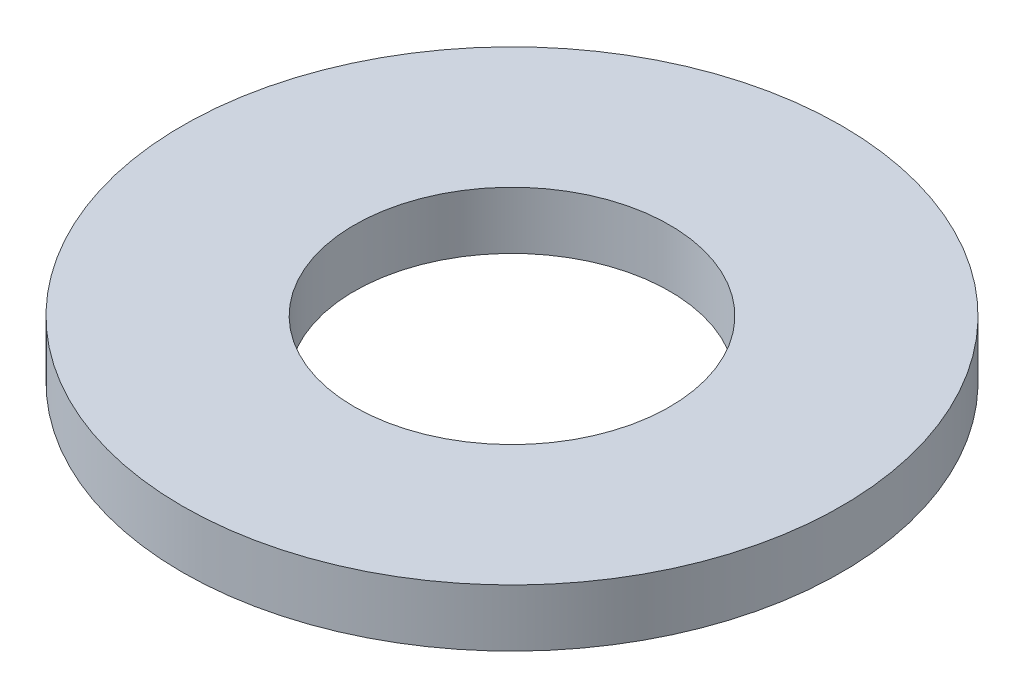
ISO-10303-21;
HEADER;
FILE_DESCRIPTION(('STEP AP214'),'2;1');
FILE_NAME('part.step','',(''),(''),'','','');
FILE_SCHEMA(('AUTOMOTIVE_DESIGN { 1 0 10303 214 1 1 1 1 }'));
ENDSEC;
DATA;
#1=APPLICATION_CONTEXT('core data for automotive mechanical design processes');
#2=APPLICATION_PROTOCOL_DEFINITION('international standard','automotive_design',2000,#1);
#3=PRODUCT_CONTEXT('',#1,'mechanical');
#4=PRODUCT('Part','Part','',(#3));
#5=PRODUCT_RELATED_PRODUCT_CATEGORY('part','',(#4));
#6=PRODUCT_DEFINITION_FORMATION('','',#4);
#7=PRODUCT_DEFINITION_CONTEXT('part definition',#1,'design');
#8=PRODUCT_DEFINITION('design','',#6,#7);
#9=PRODUCT_DEFINITION_SHAPE('','',#8);
#10=(LENGTH_UNIT() NAMED_UNIT(*) SI_UNIT(.MILLI.,.METRE.));
#11=(NAMED_UNIT(*) PLANE_ANGLE_UNIT() SI_UNIT($,.RADIAN.));
#12=(NAMED_UNIT(*) SI_UNIT($,.STERADIAN.) SOLID_ANGLE_UNIT());
#13=UNCERTAINTY_MEASURE_WITH_UNIT(LENGTH_MEASURE(1.E-05),#10,'distance_accuracy_value','');
#14=(GEOMETRIC_REPRESENTATION_CONTEXT(3) GLOBAL_UNCERTAINTY_ASSIGNED_CONTEXT((#13)) GLOBAL_UNIT_ASSIGNED_CONTEXT((#10,
#11,#12)) REPRESENTATION_CONTEXT('',''));
#15=CARTESIAN_POINT('',(0.,0.,0.));
#16=DIRECTION('',(0.,0.,1.));
#17=DIRECTION('',(1.,0.,0.));
#18=AXIS2_PLACEMENT_3D('',#15,#16,#17);
#19=CARTESIAN_POINT('',(0.,10.,0.));
#20=DIRECTION('',(0.,-1.,0.));
#21=DIRECTION('',(0.,0.,-1.));
#22=AXIS2_PLACEMENT_3D('',#19,#20,#21);
#23=CYLINDRICAL_SURFACE('',#22,57.5);
#24=CARTESIAN_POINT('',(0.,10.,0.));
#25=DIRECTION('',(0.,1.,0.));
#26=DIRECTION('',(0.,0.,1.));
#27=AXIS2_PLACEMENT_3D('',#24,#25,#26);
#28=CIRCLE('',#27,57.5);
#29=CARTESIAN_POINT('',(0.,10.,57.5));
#30=VERTEX_POINT('',#29);
#31=EDGE_CURVE('E10',#30,#30,#28,.T.);
#32=ORIENTED_EDGE('',*,*,#31,.F.);
#33=EDGE_LOOP('',(#32));
#34=FACE_BOUND('',#33,.T.);
#35=CARTESIAN_POINT('',(0.,0.,0.));
#36=DIRECTION('',(0.,1.,0.));
#37=DIRECTION('',(0.,0.,1.));
#38=AXIS2_PLACEMENT_3D('',#35,#36,#37);
#39=CIRCLE('',#38,57.5);
#40=CARTESIAN_POINT('',(0.,0.,57.5));
#41=VERTEX_POINT('',#40);
#42=EDGE_CURVE('E37',#41,#41,#39,.T.);
#43=ORIENTED_EDGE('',*,*,#42,.T.);
#44=EDGE_LOOP('',(#43));
#45=FACE_BOUND('',#44,.T.);
#46=ADVANCED_FACE('F40',(#34,#45),#23,.T.);
#47=CARTESIAN_POINT('',(0.,10.,0.));
#48=DIRECTION('',(0.,1.,0.));
#49=DIRECTION('',(0.,0.,1.));
#50=AXIS2_PLACEMENT_3D('',#47,#48,#49);
#51=PLANE('',#50);
#52=CARTESIAN_POINT('',(0.,10.,0.));
#53=DIRECTION('',(0.,1.,0.));
#54=DIRECTION('',(0.,0.,1.));
#55=AXIS2_PLACEMENT_3D('',#52,#53,#54);
#56=CIRCLE('',#55,27.5);
#57=CARTESIAN_POINT('',(0.,10.,27.5));
#58=VERTEX_POINT('',#57);
#59=EDGE_CURVE('E50',#58,#58,#56,.T.);
#60=ORIENTED_EDGE('',*,*,#59,.F.);
#61=EDGE_LOOP('',(#60));
#62=FACE_BOUND('',#61,.T.);
#63=ORIENTED_EDGE('',*,*,#31,.T.);
#64=EDGE_LOOP('',(#63));
#65=FACE_BOUND('',#64,.T.);
#66=ADVANCED_FACE('F59',(#62,#65),#51,.T.);
#67=CARTESIAN_POINT('',(0.,0.,0.));
#68=DIRECTION('',(0.,1.,0.));
#69=DIRECTION('',(0.,0.,1.));
#70=AXIS2_PLACEMENT_3D('',#67,#68,#69);
#71=PLANE('',#70);
#72=CARTESIAN_POINT('',(0.,0.,0.));
#73=DIRECTION('',(0.,1.,0.));
#74=DIRECTION('',(0.,0.,1.));
#75=AXIS2_PLACEMENT_3D('',#72,#73,#74);
#76=CIRCLE('',#75,27.5);
#77=CARTESIAN_POINT('',(0.,0.,27.5));
#78=VERTEX_POINT('',#77);
#79=EDGE_CURVE('E47',#78,#78,#76,.T.);
#80=ORIENTED_EDGE('',*,*,#79,.T.);
#81=EDGE_LOOP('',(#80));
#82=FACE_BOUND('',#81,.T.);
#83=ORIENTED_EDGE('',*,*,#42,.F.);
#84=EDGE_LOOP('',(#83));
#85=FACE_BOUND('',#84,.T.);
#86=ADVANCED_FACE('F58',(#82,#85),#71,.F.);
#87=CARTESIAN_POINT('',(0.,10.,0.));
#88=DIRECTION('',(0.,-1.,0.));
#89=DIRECTION('',(0.,0.,-1.));
#90=AXIS2_PLACEMENT_3D('',#87,#88,#89);
#91=CYLINDRICAL_SURFACE('',#90,27.5);
#92=ORIENTED_EDGE('',*,*,#59,.T.);
#93=EDGE_LOOP('',(#92));
#94=FACE_BOUND('',#93,.T.);
#95=ORIENTED_EDGE('',*,*,#79,.F.);
#96=EDGE_LOOP('',(#95));
#97=FACE_BOUND('',#96,.T.);
#98=ADVANCED_FACE('F54',(#94,#97),#91,.F.);
#99=CLOSED_SHELL('',(#46,#66,#86,#98));
#100=MANIFOLD_SOLID_BREP('B2',#99);
#101=ADVANCED_BREP_SHAPE_REPRESENTATION('',(#18,#100),#14);
#102=SHAPE_DEFINITION_REPRESENTATION(#9,#101);
ENDSEC;
END-ISO-10303-21;
